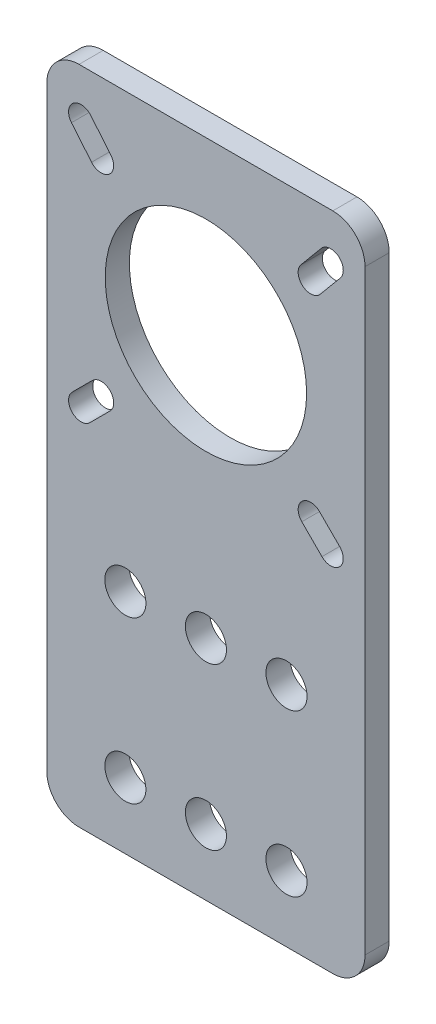
ISO-10303-21;
HEADER;
FILE_DESCRIPTION(('STEP AP214'),'2;1');
FILE_NAME('part.step','',(''),(''),'','','');
FILE_SCHEMA(('AUTOMOTIVE_DESIGN { 1 0 10303 214 1 1 1 1 }'));
ENDSEC;
DATA;
#1=APPLICATION_CONTEXT('core data for automotive mechanical design processes');
#2=APPLICATION_PROTOCOL_DEFINITION('international standard','automotive_design',2000,#1);
#3=PRODUCT_CONTEXT('',#1,'mechanical');
#4=PRODUCT('Part','Part','',(#3));
#5=PRODUCT_RELATED_PRODUCT_CATEGORY('part','',(#4));
#6=PRODUCT_DEFINITION_FORMATION('','',#4);
#7=PRODUCT_DEFINITION_CONTEXT('part definition',#1,'design');
#8=PRODUCT_DEFINITION('design','',#6,#7);
#9=PRODUCT_DEFINITION_SHAPE('','',#8);
#10=(LENGTH_UNIT() NAMED_UNIT(*) SI_UNIT(.MILLI.,.METRE.));
#11=(NAMED_UNIT(*) PLANE_ANGLE_UNIT() SI_UNIT($,.RADIAN.));
#12=(NAMED_UNIT(*) SI_UNIT($,.STERADIAN.) SOLID_ANGLE_UNIT());
#13=UNCERTAINTY_MEASURE_WITH_UNIT(LENGTH_MEASURE(1.E-05),#10,'distance_accuracy_value','');
#14=(GEOMETRIC_REPRESENTATION_CONTEXT(3) GLOBAL_UNCERTAINTY_ASSIGNED_CONTEXT((#13)) GLOBAL_UNIT_ASSIGNED_CONTEXT((#10,
#11,#12)) REPRESENTATION_CONTEXT('',''));
#15=CARTESIAN_POINT('',(0.,0.,0.));
#16=DIRECTION('',(0.,0.,1.));
#17=DIRECTION('',(1.,0.,0.));
#18=AXIS2_PLACEMENT_3D('',#15,#16,#17);
#19=CARTESIAN_POINT('',(-15.75,-37.,3.));
#20=DIRECTION('',(0.,0.,-1.));
#21=DIRECTION('',(-1.,0.,0.));
#22=AXIS2_PLACEMENT_3D('',#19,#20,#21);
#23=PLANE('',#22);
#24=CARTESIAN_POINT('',(-13.,6.75000000000001,3.));
#25=DIRECTION('',(0.,0.,1.));
#26=DIRECTION('',(1.,0.,0.));
#27=AXIS2_PLACEMENT_3D('',#24,#25,#26);
#28=CIRCLE('',#27,1.55);
#29=CARTESIAN_POINT('',(-11.9039844891608,5.65398448916086,3.));
#30=VERTEX_POINT('',#29);
#31=CARTESIAN_POINT('',(-14.0960155108391,7.84601551083916,3.));
#32=VERTEX_POINT('',#31);
#33=EDGE_CURVE('E237',#30,#32,#28,.T.);
#34=ORIENTED_EDGE('',*,*,#33,.F.);
#35=DIRECTION('',(0.707106781186545,0.70710678118655,0.));
#36=VECTOR('',#35,1.);
#37=CARTESIAN_POINT('',(-11.9039844891608,5.65398448916086,3.));
#38=LINE('',#37,#36);
#39=CARTESIAN_POINT('',(-14.4039844891608,3.15398448916085,3.));
#40=VERTEX_POINT('',#39);
#41=EDGE_CURVE('E245',#40,#30,#38,.T.);
#42=ORIENTED_EDGE('',*,*,#41,.F.);
#43=CARTESIAN_POINT('',(-15.5,4.24999999999999,3.));
#44=DIRECTION('',(0.,0.,1.));
#45=DIRECTION('',(1.,0.,0.));
#46=AXIS2_PLACEMENT_3D('',#43,#44,#45);
#47=CIRCLE('',#46,1.55000000000001);
#48=CARTESIAN_POINT('',(-16.5960155108392,5.34601551083914,3.));
#49=VERTEX_POINT('',#48);
#50=EDGE_CURVE('E242',#49,#40,#47,.T.);
#51=ORIENTED_EDGE('',*,*,#50,.F.);
#52=DIRECTION('',(-0.707106781186547,-0.707106781186548,0.));
#53=VECTOR('',#52,1.);
#54=CARTESIAN_POINT('',(-14.0960155108391,7.84601551083916,3.));
#55=LINE('',#54,#53);
#56=EDGE_CURVE('E239',#32,#49,#55,.T.);
#57=ORIENTED_EDGE('',*,*,#56,.F.);
#58=EDGE_LOOP('',(#34,#42,#51,#57));
#59=FACE_BOUND('',#58,.T.);
#60=CARTESIAN_POINT('',(-15.5,35.25,3.));
#61=DIRECTION('',(0.,0.,1.));
#62=DIRECTION('',(1.,0.,0.));
#63=AXIS2_PLACEMENT_3D('',#60,#61,#62);
#64=CIRCLE('',#63,1.55);
#65=CARTESIAN_POINT('',(-14.3092570166241,36.24228581948,3.));
#66=VERTEX_POINT('',#65);
#67=CARTESIAN_POINT('',(-16.6907429833759,34.2577141805201,3.));
#68=VERTEX_POINT('',#67);
#69=EDGE_CURVE('E299',#66,#68,#64,.T.);
#70=ORIENTED_EDGE('',*,*,#69,.F.);
#71=DIRECTION('',(-0.640184399664479,0.768221279597376,0.));
#72=VECTOR('',#71,1.);
#73=CARTESIAN_POINT('',(-14.3092570166241,36.24228581948,3.));
#74=LINE('',#73,#72);
#75=CARTESIAN_POINT('',(-11.8092570166241,33.24228581948,3.));
#76=VERTEX_POINT('',#75);
#77=EDGE_CURVE('E307',#76,#66,#74,.T.);
#78=ORIENTED_EDGE('',*,*,#77,.F.);
#79=CARTESIAN_POINT('',(-13.,32.25,3.));
#80=DIRECTION('',(0.,0.,1.));
#81=DIRECTION('',(1.,0.,0.));
#82=AXIS2_PLACEMENT_3D('',#79,#80,#81);
#83=CIRCLE('',#82,1.55);
#84=CARTESIAN_POINT('',(-14.1907429833759,31.2577141805201,3.));
#85=VERTEX_POINT('',#84);
#86=EDGE_CURVE('E304',#85,#76,#83,.T.);
#87=ORIENTED_EDGE('',*,*,#86,.F.);
#88=DIRECTION('',(0.640184399664479,-0.768221279597376,0.));
#89=VECTOR('',#88,1.);
#90=CARTESIAN_POINT('',(-16.6907429833759,34.2577141805201,3.));
#91=LINE('',#90,#89);
#92=EDGE_CURVE('E301',#68,#85,#91,.T.);
#93=ORIENTED_EDGE('',*,*,#92,.F.);
#94=EDGE_LOOP('',(#70,#78,#87,#93));
#95=FACE_BOUND('',#94,.T.);
#96=CARTESIAN_POINT('',(-15.75,-37.,3.));
#97=DIRECTION('',(0.,0.,1.));
#98=DIRECTION('',(-1.,0.,0.));
#99=AXIS2_PLACEMENT_3D('',#96,#97,#98);
#100=CIRCLE('',#99,4.);
#101=CARTESIAN_POINT('',(-19.75,-37.,3.));
#102=VERTEX_POINT('',#101);
#103=CARTESIAN_POINT('',(-15.75,-41.,3.));
#104=VERTEX_POINT('',#103);
#105=EDGE_CURVE('E336',#102,#104,#100,.T.);
#106=ORIENTED_EDGE('',*,*,#105,.T.);
#107=DIRECTION('',(1.,0.,0.));
#108=VECTOR('',#107,1.);
#109=CARTESIAN_POINT('',(-15.75,-41.,3.));
#110=LINE('',#109,#108);
#111=CARTESIAN_POINT('',(15.75,-41.,3.));
#112=VERTEX_POINT('',#111);
#113=EDGE_CURVE('E339',#104,#112,#110,.T.);
#114=ORIENTED_EDGE('',*,*,#113,.T.);
#115=CARTESIAN_POINT('',(15.75,-37.,3.));
#116=DIRECTION('',(0.,0.,1.));
#117=DIRECTION('',(1.,0.,0.));
#118=AXIS2_PLACEMENT_3D('',#115,#116,#117);
#119=CIRCLE('',#118,4.);
#120=CARTESIAN_POINT('',(19.75,-37.,3.));
#121=VERTEX_POINT('',#120);
#122=EDGE_CURVE('E342',#112,#121,#119,.T.);
#123=ORIENTED_EDGE('',*,*,#122,.T.);
#124=DIRECTION('',(0.,1.,0.));
#125=VECTOR('',#124,1.);
#126=CARTESIAN_POINT('',(19.75,-37.,3.));
#127=LINE('',#126,#125);
#128=CARTESIAN_POINT('',(19.75,37.,3.));
#129=VERTEX_POINT('',#128);
#130=EDGE_CURVE('E344',#121,#129,#127,.T.);
#131=ORIENTED_EDGE('',*,*,#130,.T.);
#132=CARTESIAN_POINT('',(15.75,37.,3.));
#133=DIRECTION('',(0.,0.,1.));
#134=DIRECTION('',(-1.,0.,0.));
#135=AXIS2_PLACEMENT_3D('',#132,#133,#134);
#136=CIRCLE('',#135,4.);
#137=CARTESIAN_POINT('',(15.75,41.,3.));
#138=VERTEX_POINT('',#137);
#139=EDGE_CURVE('E346',#129,#138,#136,.T.);
#140=ORIENTED_EDGE('',*,*,#139,.T.);
#141=DIRECTION('',(-1.,0.,0.));
#142=VECTOR('',#141,1.);
#143=CARTESIAN_POINT('',(-15.75,41.,3.));
#144=LINE('',#143,#142);
#145=CARTESIAN_POINT('',(-15.75,41.,3.));
#146=VERTEX_POINT('',#145);
#147=EDGE_CURVE('E348',#138,#146,#144,.T.);
#148=ORIENTED_EDGE('',*,*,#147,.T.);
#149=CARTESIAN_POINT('',(-15.75,37.,3.));
#150=DIRECTION('',(0.,0.,1.));
#151=DIRECTION('',(-1.,0.,0.));
#152=AXIS2_PLACEMENT_3D('',#149,#150,#151);
#153=CIRCLE('',#152,4.);
#154=CARTESIAN_POINT('',(-19.75,37.,3.));
#155=VERTEX_POINT('',#154);
#156=EDGE_CURVE('E350',#146,#155,#153,.T.);
#157=ORIENTED_EDGE('',*,*,#156,.T.);
#158=DIRECTION('',(0.,-1.,0.));
#159=VECTOR('',#158,1.);
#160=CARTESIAN_POINT('',(-19.75,-37.,3.));
#161=LINE('',#160,#159);
#162=EDGE_CURVE('E352',#155,#102,#161,.T.);
#163=ORIENTED_EDGE('',*,*,#162,.T.);
#164=EDGE_LOOP('',(#106,#114,#123,#131,#140,#148,#157,#163));
#165=FACE_BOUND('',#164,.T.);
#166=CARTESIAN_POINT('',(0.,19.75,3.));
#167=DIRECTION('',(0.,0.,1.));
#168=DIRECTION('',(1.,0.,0.));
#169=AXIS2_PLACEMENT_3D('',#166,#167,#168);
#170=CIRCLE('',#169,12.5);
#171=CARTESIAN_POINT('',(12.5,19.75,3.));
#172=VERTEX_POINT('',#171);
#173=EDGE_CURVE('E330',#172,#172,#170,.T.);
#174=ORIENTED_EDGE('',*,*,#173,.F.);
#175=EDGE_LOOP('',(#174));
#176=FACE_BOUND('',#175,.T.);
#177=CARTESIAN_POINT('',(15.5,35.25,3.));
#178=DIRECTION('',(0.,0.,1.));
#179=DIRECTION('',(-1.,0.,0.));
#180=AXIS2_PLACEMENT_3D('',#177,#178,#179);
#181=CIRCLE('',#180,1.55);
#182=CARTESIAN_POINT('',(16.6907429833759,34.2577141805201,3.));
#183=VERTEX_POINT('',#182);
#184=CARTESIAN_POINT('',(14.3092570166241,36.24228581948,3.));
#185=VERTEX_POINT('',#184);
#186=EDGE_CURVE('E268',#183,#185,#181,.T.);
#187=ORIENTED_EDGE('',*,*,#186,.F.);
#188=DIRECTION('',(0.640184399664479,0.768221279597376,0.));
#189=VECTOR('',#188,1.);
#190=CARTESIAN_POINT('',(16.6907429833759,34.2577141805201,3.));
#191=LINE('',#190,#189);
#192=CARTESIAN_POINT('',(14.1907429833759,31.2577141805201,3.));
#193=VERTEX_POINT('',#192);
#194=EDGE_CURVE('E276',#193,#183,#191,.T.);
#195=ORIENTED_EDGE('',*,*,#194,.F.);
#196=CARTESIAN_POINT('',(13.,32.25,3.));
#197=DIRECTION('',(0.,0.,1.));
#198=DIRECTION('',(-1.,0.,0.));
#199=AXIS2_PLACEMENT_3D('',#196,#197,#198);
#200=CIRCLE('',#199,1.55);
#201=CARTESIAN_POINT('',(11.8092570166241,33.24228581948,3.));
#202=VERTEX_POINT('',#201);
#203=EDGE_CURVE('E273',#202,#193,#200,.T.);
#204=ORIENTED_EDGE('',*,*,#203,.F.);
#205=DIRECTION('',(-0.640184399664479,-0.768221279597376,0.));
#206=VECTOR('',#205,1.);
#207=CARTESIAN_POINT('',(14.3092570166241,36.24228581948,3.));
#208=LINE('',#207,#206);
#209=EDGE_CURVE('E270',#185,#202,#208,.T.);
#210=ORIENTED_EDGE('',*,*,#209,.F.);
#211=EDGE_LOOP('',(#187,#195,#204,#210));
#212=FACE_BOUND('',#211,.T.);
#213=CARTESIAN_POINT('',(13.,6.75000000000001,3.));
#214=DIRECTION('',(0.,0.,1.));
#215=DIRECTION('',(-1.,0.,0.));
#216=AXIS2_PLACEMENT_3D('',#213,#214,#215);
#217=CIRCLE('',#216,1.55);
#218=CARTESIAN_POINT('',(14.0960155108392,7.84601551083916,3.));
#219=VERTEX_POINT('',#218);
#220=CARTESIAN_POINT('',(11.9039844891608,5.65398448916086,3.));
#221=VERTEX_POINT('',#220);
#222=EDGE_CURVE('E198',#219,#221,#217,.T.);
#223=ORIENTED_EDGE('',*,*,#222,.F.);
#224=DIRECTION('',(-0.707106781186547,0.707106781186548,0.));
#225=VECTOR('',#224,1.);
#226=CARTESIAN_POINT('',(14.0960155108392,7.84601551083916,3.));
#227=LINE('',#226,#225);
#228=CARTESIAN_POINT('',(16.5960155108392,5.34601551083914,3.));
#229=VERTEX_POINT('',#228);
#230=EDGE_CURVE('E221',#229,#219,#227,.T.);
#231=ORIENTED_EDGE('',*,*,#230,.F.);
#232=CARTESIAN_POINT('',(15.5,4.24999999999999,3.));
#233=DIRECTION('',(0.,0.,1.));
#234=DIRECTION('',(-1.,0.,0.));
#235=AXIS2_PLACEMENT_3D('',#232,#233,#234);
#236=CIRCLE('',#235,1.55000000000001);
#237=CARTESIAN_POINT('',(14.4039844891608,3.15398448916085,3.));
#238=VERTEX_POINT('',#237);
#239=EDGE_CURVE('E219',#238,#229,#236,.T.);
#240=ORIENTED_EDGE('',*,*,#239,.F.);
#241=DIRECTION('',(0.707106781186544,-0.707106781186551,0.));
#242=VECTOR('',#241,1.);
#243=CARTESIAN_POINT('',(11.9039844891608,5.65398448916086,3.));
#244=LINE('',#243,#242);
#245=EDGE_CURVE('E206',#221,#238,#244,.T.);
#246=ORIENTED_EDGE('',*,*,#245,.F.);
#247=EDGE_LOOP('',(#223,#231,#240,#246));
#248=FACE_BOUND('',#247,.T.);
#249=CARTESIAN_POINT('',(-10.,-12.8,3.));
#250=DIRECTION('',(0.,0.,1.));
#251=DIRECTION('',(1.,0.,0.));
#252=AXIS2_PLACEMENT_3D('',#249,#250,#251);
#253=CIRCLE('',#252,2.55);
#254=CARTESIAN_POINT('',(-7.45,-12.8,3.));
#255=VERTEX_POINT('',#254);
#256=EDGE_CURVE('E227',#255,#255,#253,.T.);
#257=ORIENTED_EDGE('',*,*,#256,.F.);
#258=EDGE_LOOP('',(#257));
#259=FACE_BOUND('',#258,.T.);
#260=CARTESIAN_POINT('',(0.,-12.8,3.));
#261=DIRECTION('',(0.,0.,1.));
#262=DIRECTION('',(1.,0.,0.));
#263=AXIS2_PLACEMENT_3D('',#260,#261,#262);
#264=CIRCLE('',#263,2.55);
#265=CARTESIAN_POINT('',(2.55000000000001,-12.8,3.));
#266=VERTEX_POINT('',#265);
#267=EDGE_CURVE('E506',#266,#266,#264,.T.);
#268=ORIENTED_EDGE('',*,*,#267,.F.);
#269=EDGE_LOOP('',(#268));
#270=FACE_BOUND('',#269,.T.);
#271=CARTESIAN_POINT('',(10.,-12.8,3.));
#272=DIRECTION('',(0.,0.,1.));
#273=DIRECTION('',(1.,0.,0.));
#274=AXIS2_PLACEMENT_3D('',#271,#272,#273);
#275=CIRCLE('',#274,2.55);
#276=CARTESIAN_POINT('',(12.55,-12.8,3.));
#277=VERTEX_POINT('',#276);
#278=EDGE_CURVE('E501',#277,#277,#275,.T.);
#279=ORIENTED_EDGE('',*,*,#278,.F.);
#280=EDGE_LOOP('',(#279));
#281=FACE_BOUND('',#280,.T.);
#282=CARTESIAN_POINT('',(10.,-32.8,3.));
#283=DIRECTION('',(0.,0.,1.));
#284=DIRECTION('',(-1.,0.,0.));
#285=AXIS2_PLACEMENT_3D('',#282,#283,#284);
#286=CIRCLE('',#285,2.55);
#287=CARTESIAN_POINT('',(7.45,-32.8,3.));
#288=VERTEX_POINT('',#287);
#289=EDGE_CURVE('E496',#288,#288,#286,.T.);
#290=ORIENTED_EDGE('',*,*,#289,.F.);
#291=EDGE_LOOP('',(#290));
#292=FACE_BOUND('',#291,.T.);
#293=CARTESIAN_POINT('',(0.,-32.8,3.));
#294=DIRECTION('',(0.,0.,1.));
#295=DIRECTION('',(-1.,0.,0.));
#296=AXIS2_PLACEMENT_3D('',#293,#294,#295);
#297=CIRCLE('',#296,2.55);
#298=CARTESIAN_POINT('',(-2.54999999999999,-32.8,3.));
#299=VERTEX_POINT('',#298);
#300=EDGE_CURVE('E491',#299,#299,#297,.T.);
#301=ORIENTED_EDGE('',*,*,#300,.F.);
#302=EDGE_LOOP('',(#301));
#303=FACE_BOUND('',#302,.T.);
#304=CARTESIAN_POINT('',(-9.99999999999999,-32.8,3.));
#305=DIRECTION('',(0.,0.,1.));
#306=DIRECTION('',(-1.,0.,0.));
#307=AXIS2_PLACEMENT_3D('',#304,#305,#306);
#308=CIRCLE('',#307,2.55);
#309=CARTESIAN_POINT('',(-12.55,-32.8,3.));
#310=VERTEX_POINT('',#309);
#311=EDGE_CURVE('E485',#310,#310,#308,.T.);
#312=ORIENTED_EDGE('',*,*,#311,.F.);
#313=EDGE_LOOP('',(#312));
#314=FACE_BOUND('',#313,.T.);
#315=ADVANCED_FACE('F37',(#59,#95,#165,#176,#212,#248,#259,#270,#281,#292,#303,#314),#23,.F.);
#316=CARTESIAN_POINT('',(-15.75,-37.,0.));
#317=DIRECTION('',(0.,0.,-1.));
#318=DIRECTION('',(-1.,0.,0.));
#319=AXIS2_PLACEMENT_3D('',#316,#317,#318);
#320=PLANE('',#319);
#321=CARTESIAN_POINT('',(0.,-32.8,0.));
#322=DIRECTION('',(0.,0.,1.));
#323=DIRECTION('',(-1.,0.,0.));
#324=AXIS2_PLACEMENT_3D('',#321,#322,#323);
#325=CIRCLE('',#324,2.55);
#326=CARTESIAN_POINT('',(-2.54999999999999,-32.8,0.));
#327=VERTEX_POINT('',#326);
#328=EDGE_CURVE('E488',#327,#327,#325,.T.);
#329=ORIENTED_EDGE('',*,*,#328,.T.);
#330=EDGE_LOOP('',(#329));
#331=FACE_BOUND('',#330,.T.);
#332=CARTESIAN_POINT('',(10.,-12.8,0.));
#333=DIRECTION('',(0.,0.,1.));
#334=DIRECTION('',(1.,0.,0.));
#335=AXIS2_PLACEMENT_3D('',#332,#333,#334);
#336=CIRCLE('',#335,2.55);
#337=CARTESIAN_POINT('',(12.55,-12.8,0.));
#338=VERTEX_POINT('',#337);
#339=EDGE_CURVE('E499',#338,#338,#336,.T.);
#340=ORIENTED_EDGE('',*,*,#339,.T.);
#341=EDGE_LOOP('',(#340));
#342=FACE_BOUND('',#341,.T.);
#343=CARTESIAN_POINT('',(-10.,-12.8,0.));
#344=DIRECTION('',(0.,0.,1.));
#345=DIRECTION('',(1.,0.,0.));
#346=AXIS2_PLACEMENT_3D('',#343,#344,#345);
#347=CIRCLE('',#346,2.55);
#348=CARTESIAN_POINT('',(-7.45,-12.8,0.));
#349=VERTEX_POINT('',#348);
#350=EDGE_CURVE('E509',#349,#349,#347,.T.);
#351=ORIENTED_EDGE('',*,*,#350,.T.);
#352=EDGE_LOOP('',(#351));
#353=FACE_BOUND('',#352,.T.);
#354=CARTESIAN_POINT('',(-15.75,-37.,0.));
#355=DIRECTION('',(0.,0.,1.));
#356=DIRECTION('',(-1.,0.,0.));
#357=AXIS2_PLACEMENT_3D('',#354,#355,#356);
#358=CIRCLE('',#357,4.);
#359=CARTESIAN_POINT('',(-19.75,-37.,0.));
#360=VERTEX_POINT('',#359);
#361=CARTESIAN_POINT('',(-15.75,-41.,0.));
#362=VERTEX_POINT('',#361);
#363=EDGE_CURVE('E333',#360,#362,#358,.T.);
#364=ORIENTED_EDGE('',*,*,#363,.F.);
#365=DIRECTION('',(0.,-1.,0.));
#366=VECTOR('',#365,1.);
#367=CARTESIAN_POINT('',(-19.75,-37.,0.));
#368=LINE('',#367,#366);
#369=CARTESIAN_POINT('',(-19.75,37.,0.));
#370=VERTEX_POINT('',#369);
#371=EDGE_CURVE('E340',#370,#360,#368,.T.);
#372=ORIENTED_EDGE('',*,*,#371,.F.);
#373=CARTESIAN_POINT('',(-15.75,37.,0.));
#374=DIRECTION('',(0.,0.,1.));
#375=DIRECTION('',(-1.,0.,0.));
#376=AXIS2_PLACEMENT_3D('',#373,#374,#375);
#377=CIRCLE('',#376,4.);
#378=CARTESIAN_POINT('',(-15.75,41.,0.));
#379=VERTEX_POINT('',#378);
#380=EDGE_CURVE('E367',#379,#370,#377,.T.);
#381=ORIENTED_EDGE('',*,*,#380,.F.);
#382=DIRECTION('',(-1.,0.,0.));
#383=VECTOR('',#382,1.);
#384=CARTESIAN_POINT('',(-15.75,41.,0.));
#385=LINE('',#384,#383);
#386=CARTESIAN_POINT('',(15.75,41.,0.));
#387=VERTEX_POINT('',#386);
#388=EDGE_CURVE('E365',#387,#379,#385,.T.);
#389=ORIENTED_EDGE('',*,*,#388,.F.);
#390=CARTESIAN_POINT('',(15.75,37.,0.));
#391=DIRECTION('',(0.,0.,1.));
#392=DIRECTION('',(-1.,0.,0.));
#393=AXIS2_PLACEMENT_3D('',#390,#391,#392);
#394=CIRCLE('',#393,4.);
#395=CARTESIAN_POINT('',(19.75,37.,0.));
#396=VERTEX_POINT('',#395);
#397=EDGE_CURVE('E363',#396,#387,#394,.T.);
#398=ORIENTED_EDGE('',*,*,#397,.F.);
#399=DIRECTION('',(0.,1.,0.));
#400=VECTOR('',#399,1.);
#401=CARTESIAN_POINT('',(19.75,-37.,0.));
#402=LINE('',#401,#400);
#403=CARTESIAN_POINT('',(19.75,-37.,0.));
#404=VERTEX_POINT('',#403);
#405=EDGE_CURVE('E361',#404,#396,#402,.T.);
#406=ORIENTED_EDGE('',*,*,#405,.F.);
#407=CARTESIAN_POINT('',(15.75,-37.,0.));
#408=DIRECTION('',(0.,0.,1.));
#409=DIRECTION('',(1.,0.,0.));
#410=AXIS2_PLACEMENT_3D('',#407,#408,#409);
#411=CIRCLE('',#410,4.);
#412=CARTESIAN_POINT('',(15.75,-41.,0.));
#413=VERTEX_POINT('',#412);
#414=EDGE_CURVE('E359',#413,#404,#411,.T.);
#415=ORIENTED_EDGE('',*,*,#414,.F.);
#416=DIRECTION('',(1.,0.,0.));
#417=VECTOR('',#416,1.);
#418=CARTESIAN_POINT('',(-15.75,-41.,0.));
#419=LINE('',#418,#417);
#420=EDGE_CURVE('E357',#362,#413,#419,.T.);
#421=ORIENTED_EDGE('',*,*,#420,.F.);
#422=EDGE_LOOP('',(#364,#372,#381,#389,#398,#406,#415,#421));
#423=FACE_BOUND('',#422,.T.);
#424=CARTESIAN_POINT('',(0.,19.75,0.));
#425=DIRECTION('',(0.,0.,1.));
#426=DIRECTION('',(1.,0.,0.));
#427=AXIS2_PLACEMENT_3D('',#424,#425,#426);
#428=CIRCLE('',#427,12.5);
#429=CARTESIAN_POINT('',(12.5,19.75,0.));
#430=VERTEX_POINT('',#429);
#431=EDGE_CURVE('E329',#430,#430,#428,.T.);
#432=ORIENTED_EDGE('',*,*,#431,.T.);
#433=EDGE_LOOP('',(#432));
#434=FACE_BOUND('',#433,.T.);
#435=DIRECTION('',(-0.640184399664479,0.768221279597376,0.));
#436=VECTOR('',#435,1.);
#437=CARTESIAN_POINT('',(-14.3092570166241,36.24228581948,0.));
#438=LINE('',#437,#436);
#439=CARTESIAN_POINT('',(-11.8092570166241,33.24228581948,0.));
#440=VERTEX_POINT('',#439);
#441=CARTESIAN_POINT('',(-14.3092570166241,36.24228581948,0.));
#442=VERTEX_POINT('',#441);
#443=EDGE_CURVE('E302',#440,#442,#438,.T.);
#444=ORIENTED_EDGE('',*,*,#443,.T.);
#445=CARTESIAN_POINT('',(-15.5,35.25,0.));
#446=DIRECTION('',(0.,0.,1.));
#447=DIRECTION('',(1.,0.,0.));
#448=AXIS2_PLACEMENT_3D('',#445,#446,#447);
#449=CIRCLE('',#448,1.55);
#450=CARTESIAN_POINT('',(-16.6907429833759,34.2577141805201,0.));
#451=VERTEX_POINT('',#450);
#452=EDGE_CURVE('E298',#442,#451,#449,.T.);
#453=ORIENTED_EDGE('',*,*,#452,.T.);
#454=DIRECTION('',(0.640184399664479,-0.768221279597376,0.));
#455=VECTOR('',#454,1.);
#456=CARTESIAN_POINT('',(-16.6907429833759,34.2577141805201,0.));
#457=LINE('',#456,#455);
#458=CARTESIAN_POINT('',(-14.1907429833759,31.2577141805201,0.));
#459=VERTEX_POINT('',#458);
#460=EDGE_CURVE('E312',#451,#459,#457,.T.);
#461=ORIENTED_EDGE('',*,*,#460,.T.);
#462=CARTESIAN_POINT('',(-13.,32.25,0.));
#463=DIRECTION('',(0.,0.,1.));
#464=DIRECTION('',(1.,0.,0.));
#465=AXIS2_PLACEMENT_3D('',#462,#463,#464);
#466=CIRCLE('',#465,1.55);
#467=EDGE_CURVE('E315',#459,#440,#466,.T.);
#468=ORIENTED_EDGE('',*,*,#467,.T.);
#469=EDGE_LOOP('',(#444,#453,#461,#468));
#470=FACE_BOUND('',#469,.T.);
#471=DIRECTION('',(0.640184399664479,0.768221279597376,0.));
#472=VECTOR('',#471,1.);
#473=CARTESIAN_POINT('',(16.6907429833759,34.2577141805201,0.));
#474=LINE('',#473,#472);
#475=CARTESIAN_POINT('',(14.1907429833759,31.2577141805201,0.));
#476=VERTEX_POINT('',#475);
#477=CARTESIAN_POINT('',(16.6907429833759,34.2577141805201,0.));
#478=VERTEX_POINT('',#477);
#479=EDGE_CURVE('E271',#476,#478,#474,.T.);
#480=ORIENTED_EDGE('',*,*,#479,.T.);
#481=CARTESIAN_POINT('',(15.5,35.25,0.));
#482=DIRECTION('',(0.,0.,1.));
#483=DIRECTION('',(-1.,0.,0.));
#484=AXIS2_PLACEMENT_3D('',#481,#482,#483);
#485=CIRCLE('',#484,1.55);
#486=CARTESIAN_POINT('',(14.3092570166241,36.24228581948,0.));
#487=VERTEX_POINT('',#486);
#488=EDGE_CURVE('E267',#478,#487,#485,.T.);
#489=ORIENTED_EDGE('',*,*,#488,.T.);
#490=DIRECTION('',(-0.640184399664479,-0.768221279597376,0.));
#491=VECTOR('',#490,1.);
#492=CARTESIAN_POINT('',(14.3092570166241,36.24228581948,0.));
#493=LINE('',#492,#491);
#494=CARTESIAN_POINT('',(11.8092570166241,33.24228581948,0.));
#495=VERTEX_POINT('',#494);
#496=EDGE_CURVE('E281',#487,#495,#493,.T.);
#497=ORIENTED_EDGE('',*,*,#496,.T.);
#498=CARTESIAN_POINT('',(13.,32.25,0.));
#499=DIRECTION('',(0.,0.,1.));
#500=DIRECTION('',(-1.,0.,0.));
#501=AXIS2_PLACEMENT_3D('',#498,#499,#500);
#502=CIRCLE('',#501,1.55);
#503=EDGE_CURVE('E284',#495,#476,#502,.T.);
#504=ORIENTED_EDGE('',*,*,#503,.T.);
#505=EDGE_LOOP('',(#480,#489,#497,#504));
#506=FACE_BOUND('',#505,.T.);
#507=DIRECTION('',(0.707106781186545,0.70710678118655,0.));
#508=VECTOR('',#507,1.);
#509=CARTESIAN_POINT('',(-11.9039844891608,5.65398448916086,0.));
#510=LINE('',#509,#508);
#511=CARTESIAN_POINT('',(-14.4039844891608,3.15398448916084,0.));
#512=VERTEX_POINT('',#511);
#513=CARTESIAN_POINT('',(-11.9039844891608,5.65398448916086,0.));
#514=VERTEX_POINT('',#513);
#515=EDGE_CURVE('E240',#512,#514,#510,.T.);
#516=ORIENTED_EDGE('',*,*,#515,.T.);
#517=CARTESIAN_POINT('',(-13.,6.75000000000001,0.));
#518=DIRECTION('',(0.,0.,1.));
#519=DIRECTION('',(1.,0.,0.));
#520=AXIS2_PLACEMENT_3D('',#517,#518,#519);
#521=CIRCLE('',#520,1.55);
#522=CARTESIAN_POINT('',(-14.0960155108391,7.84601551083916,0.));
#523=VERTEX_POINT('',#522);
#524=EDGE_CURVE('E214',#514,#523,#521,.T.);
#525=ORIENTED_EDGE('',*,*,#524,.T.);
#526=DIRECTION('',(-0.707106781186547,-0.707106781186548,0.));
#527=VECTOR('',#526,1.);
#528=CARTESIAN_POINT('',(-14.0960155108391,7.84601551083916,0.));
#529=LINE('',#528,#527);
#530=CARTESIAN_POINT('',(-16.5960155108392,5.34601551083914,0.));
#531=VERTEX_POINT('',#530);
#532=EDGE_CURVE('E250',#523,#531,#529,.T.);
#533=ORIENTED_EDGE('',*,*,#532,.T.);
#534=CARTESIAN_POINT('',(-15.5,4.24999999999999,0.));
#535=DIRECTION('',(0.,0.,1.));
#536=DIRECTION('',(1.,0.,0.));
#537=AXIS2_PLACEMENT_3D('',#534,#535,#536);
#538=CIRCLE('',#537,1.55000000000001);
#539=EDGE_CURVE('E253',#531,#512,#538,.T.);
#540=ORIENTED_EDGE('',*,*,#539,.T.);
#541=EDGE_LOOP('',(#516,#525,#533,#540));
#542=FACE_BOUND('',#541,.T.);
#543=DIRECTION('',(-0.707106781186547,0.707106781186548,0.));
#544=VECTOR('',#543,1.);
#545=CARTESIAN_POINT('',(14.0960155108392,7.84601551083916,0.));
#546=LINE('',#545,#544);
#547=CARTESIAN_POINT('',(16.5960155108392,5.34601551083914,0.));
#548=VERTEX_POINT('',#547);
#549=CARTESIAN_POINT('',(14.0960155108392,7.84601551083915,0.));
#550=VERTEX_POINT('',#549);
#551=EDGE_CURVE('E207',#548,#550,#546,.T.);
#552=ORIENTED_EDGE('',*,*,#551,.T.);
#553=CARTESIAN_POINT('',(13.,6.75000000000001,0.));
#554=DIRECTION('',(0.,0.,1.));
#555=DIRECTION('',(-1.,0.,0.));
#556=AXIS2_PLACEMENT_3D('',#553,#554,#555);
#557=CIRCLE('',#556,1.55);
#558=CARTESIAN_POINT('',(11.9039844891608,5.65398448916086,0.));
#559=VERTEX_POINT('',#558);
#560=EDGE_CURVE('E60',#550,#559,#557,.T.);
#561=ORIENTED_EDGE('',*,*,#560,.T.);
#562=DIRECTION('',(0.707106781186544,-0.707106781186551,0.));
#563=VECTOR('',#562,1.);
#564=CARTESIAN_POINT('',(11.9039844891608,5.65398448916086,0.));
#565=LINE('',#564,#563);
#566=CARTESIAN_POINT('',(14.4039844891608,3.15398448916085,0.));
#567=VERTEX_POINT('',#566);
#568=EDGE_CURVE('E213',#559,#567,#565,.T.);
#569=ORIENTED_EDGE('',*,*,#568,.T.);
#570=CARTESIAN_POINT('',(15.5,4.24999999999999,0.));
#571=DIRECTION('',(0.,0.,1.));
#572=DIRECTION('',(-1.,0.,0.));
#573=AXIS2_PLACEMENT_3D('',#570,#571,#572);
#574=CIRCLE('',#573,1.55000000000001);
#575=EDGE_CURVE('E229',#567,#548,#574,.T.);
#576=ORIENTED_EDGE('',*,*,#575,.T.);
#577=EDGE_LOOP('',(#552,#561,#569,#576));
#578=FACE_BOUND('',#577,.T.);
#579=CARTESIAN_POINT('',(0.,-12.8,0.));
#580=DIRECTION('',(0.,0.,1.));
#581=DIRECTION('',(1.,0.,0.));
#582=AXIS2_PLACEMENT_3D('',#579,#580,#581);
#583=CIRCLE('',#582,2.55);
#584=CARTESIAN_POINT('',(2.55000000000001,-12.8,0.));
#585=VERTEX_POINT('',#584);
#586=EDGE_CURVE('E476',#585,#585,#583,.T.);
#587=ORIENTED_EDGE('',*,*,#586,.T.);
#588=EDGE_LOOP('',(#587));
#589=FACE_BOUND('',#588,.T.);
#590=CARTESIAN_POINT('',(10.,-32.8,0.));
#591=DIRECTION('',(0.,0.,1.));
#592=DIRECTION('',(-1.,0.,0.));
#593=AXIS2_PLACEMENT_3D('',#590,#591,#592);
#594=CIRCLE('',#593,2.55);
#595=CARTESIAN_POINT('',(7.45,-32.8,0.));
#596=VERTEX_POINT('',#595);
#597=EDGE_CURVE('E480',#596,#596,#594,.T.);
#598=ORIENTED_EDGE('',*,*,#597,.T.);
#599=EDGE_LOOP('',(#598));
#600=FACE_BOUND('',#599,.T.);
#601=CARTESIAN_POINT('',(-9.99999999999999,-32.8,0.));
#602=DIRECTION('',(0.,0.,1.));
#603=DIRECTION('',(-1.,0.,0.));
#604=AXIS2_PLACEMENT_3D('',#601,#602,#603);
#605=CIRCLE('',#604,2.55);
#606=CARTESIAN_POINT('',(-12.55,-32.8,0.));
#607=VERTEX_POINT('',#606);
#608=EDGE_CURVE('E483',#607,#607,#605,.T.);
#609=ORIENTED_EDGE('',*,*,#608,.T.);
#610=EDGE_LOOP('',(#609));
#611=FACE_BOUND('',#610,.T.);
#612=ADVANCED_FACE('F397',(#331,#342,#353,#423,#434,#470,#506,#542,#578,#589,#600,#611),#320,.T.);
#613=CARTESIAN_POINT('',(-15.75,-37.,3.));
#614=DIRECTION('',(0.,0.,-1.));
#615=DIRECTION('',(-1.,0.,0.));
#616=AXIS2_PLACEMENT_3D('',#613,#614,#615);
#617=CYLINDRICAL_SURFACE('',#616,4.);
#618=ORIENTED_EDGE('',*,*,#363,.T.);
#619=DIRECTION('',(0.,0.,-1.));
#620=VECTOR('',#619,1.);
#621=CARTESIAN_POINT('',(-15.75,-41.,3.));
#622=LINE('',#621,#620);
#623=EDGE_CURVE('E11',#104,#362,#622,.T.);
#624=ORIENTED_EDGE('',*,*,#623,.F.);
#625=ORIENTED_EDGE('',*,*,#105,.F.);
#626=DIRECTION('',(0.,0.,-1.));
#627=VECTOR('',#626,1.);
#628=CARTESIAN_POINT('',(-19.75,-37.,3.));
#629=LINE('',#628,#627);
#630=EDGE_CURVE('E354',#102,#360,#629,.T.);
#631=ORIENTED_EDGE('',*,*,#630,.T.);
#632=EDGE_LOOP('',(#618,#624,#625,#631));
#633=FACE_BOUND('',#632,.T.);
#634=ADVANCED_FACE('F39',(#633),#617,.T.);
#635=CARTESIAN_POINT('',(-15.75,-41.,3.));
#636=DIRECTION('',(0.,1.,0.));
#637=DIRECTION('',(0.,0.,1.));
#638=AXIS2_PLACEMENT_3D('',#635,#636,#637);
#639=PLANE('',#638);
#640=ORIENTED_EDGE('',*,*,#420,.T.);
#641=DIRECTION('',(0.,0.,-1.));
#642=VECTOR('',#641,1.);
#643=CARTESIAN_POINT('',(15.75,-41.,3.));
#644=LINE('',#643,#642);
#645=EDGE_CURVE('E45',#112,#413,#644,.T.);
#646=ORIENTED_EDGE('',*,*,#645,.F.);
#647=ORIENTED_EDGE('',*,*,#113,.F.);
#648=ORIENTED_EDGE('',*,*,#623,.T.);
#649=EDGE_LOOP('',(#640,#646,#647,#648));
#650=FACE_BOUND('',#649,.T.);
#651=ADVANCED_FACE('F415',(#650),#639,.F.);
#652=CARTESIAN_POINT('',(15.75,-37.,3.));
#653=DIRECTION('',(0.,0.,-1.));
#654=DIRECTION('',(-1.,0.,0.));
#655=AXIS2_PLACEMENT_3D('',#652,#653,#654);
#656=CYLINDRICAL_SURFACE('',#655,4.);
#657=ORIENTED_EDGE('',*,*,#414,.T.);
#658=DIRECTION('',(0.,0.,-1.));
#659=VECTOR('',#658,1.);
#660=CARTESIAN_POINT('',(19.75,-37.,3.));
#661=LINE('',#660,#659);
#662=EDGE_CURVE('E384',#121,#404,#661,.T.);
#663=ORIENTED_EDGE('',*,*,#662,.F.);
#664=ORIENTED_EDGE('',*,*,#122,.F.);
#665=ORIENTED_EDGE('',*,*,#645,.T.);
#666=EDGE_LOOP('',(#657,#663,#664,#665));
#667=FACE_BOUND('',#666,.T.);
#668=ADVANCED_FACE('F391',(#667),#656,.T.);
#669=CARTESIAN_POINT('',(19.75,-37.,3.));
#670=DIRECTION('',(-1.,0.,0.));
#671=DIRECTION('',(0.,0.,1.));
#672=AXIS2_PLACEMENT_3D('',#669,#670,#671);
#673=PLANE('',#672);
#674=ORIENTED_EDGE('',*,*,#405,.T.);
#675=DIRECTION('',(0.,0.,-1.));
#676=VECTOR('',#675,1.);
#677=CARTESIAN_POINT('',(19.75,37.,3.));
#678=LINE('',#677,#676);
#679=EDGE_CURVE('E381',#129,#396,#678,.T.);
#680=ORIENTED_EDGE('',*,*,#679,.F.);
#681=ORIENTED_EDGE('',*,*,#130,.F.);
#682=ORIENTED_EDGE('',*,*,#662,.T.);
#683=EDGE_LOOP('',(#674,#680,#681,#682));
#684=FACE_BOUND('',#683,.T.);
#685=ADVANCED_FACE('F403',(#684),#673,.F.);
#686=CARTESIAN_POINT('',(15.75,37.,3.));
#687=DIRECTION('',(0.,0.,-1.));
#688=DIRECTION('',(-1.,0.,0.));
#689=AXIS2_PLACEMENT_3D('',#686,#687,#688);
#690=CYLINDRICAL_SURFACE('',#689,4.);
#691=ORIENTED_EDGE('',*,*,#397,.T.);
#692=DIRECTION('',(0.,0.,-1.));
#693=VECTOR('',#692,1.);
#694=CARTESIAN_POINT('',(15.75,41.,3.));
#695=LINE('',#694,#693);
#696=EDGE_CURVE('E378',#138,#387,#695,.T.);
#697=ORIENTED_EDGE('',*,*,#696,.F.);
#698=ORIENTED_EDGE('',*,*,#139,.F.);
#699=ORIENTED_EDGE('',*,*,#679,.T.);
#700=EDGE_LOOP('',(#691,#697,#698,#699));
#701=FACE_BOUND('',#700,.T.);
#702=ADVANCED_FACE('F407',(#701),#690,.T.);
#703=CARTESIAN_POINT('',(-15.75,41.,3.));
#704=DIRECTION('',(0.,-1.,0.));
#705=DIRECTION('',(0.,0.,-1.));
#706=AXIS2_PLACEMENT_3D('',#703,#704,#705);
#707=PLANE('',#706);
#708=ORIENTED_EDGE('',*,*,#388,.T.);
#709=DIRECTION('',(0.,0.,-1.));
#710=VECTOR('',#709,1.);
#711=CARTESIAN_POINT('',(-15.75,41.,3.));
#712=LINE('',#711,#710);
#713=EDGE_CURVE('E375',#146,#379,#712,.T.);
#714=ORIENTED_EDGE('',*,*,#713,.F.);
#715=ORIENTED_EDGE('',*,*,#147,.F.);
#716=ORIENTED_EDGE('',*,*,#696,.T.);
#717=EDGE_LOOP('',(#708,#714,#715,#716));
#718=FACE_BOUND('',#717,.T.);
#719=ADVANCED_FACE('F428',(#718),#707,.F.);
#720=CARTESIAN_POINT('',(-15.75,37.,3.));
#721=DIRECTION('',(0.,0.,-1.));
#722=DIRECTION('',(-1.,0.,0.));
#723=AXIS2_PLACEMENT_3D('',#720,#721,#722);
#724=CYLINDRICAL_SURFACE('',#723,4.);
#725=ORIENTED_EDGE('',*,*,#380,.T.);
#726=DIRECTION('',(0.,0.,-1.));
#727=VECTOR('',#726,1.);
#728=CARTESIAN_POINT('',(-19.75,37.,3.));
#729=LINE('',#728,#727);
#730=EDGE_CURVE('E372',#155,#370,#729,.T.);
#731=ORIENTED_EDGE('',*,*,#730,.F.);
#732=ORIENTED_EDGE('',*,*,#156,.F.);
#733=ORIENTED_EDGE('',*,*,#713,.T.);
#734=EDGE_LOOP('',(#725,#731,#732,#733));
#735=FACE_BOUND('',#734,.T.);
#736=ADVANCED_FACE('F426',(#735),#724,.T.);
#737=CARTESIAN_POINT('',(-19.75,-37.,3.));
#738=DIRECTION('',(1.,0.,0.));
#739=DIRECTION('',(0.,0.,-1.));
#740=AXIS2_PLACEMENT_3D('',#737,#738,#739);
#741=PLANE('',#740);
#742=ORIENTED_EDGE('',*,*,#371,.T.);
#743=ORIENTED_EDGE('',*,*,#630,.F.);
#744=ORIENTED_EDGE('',*,*,#162,.F.);
#745=ORIENTED_EDGE('',*,*,#730,.T.);
#746=EDGE_LOOP('',(#742,#743,#744,#745));
#747=FACE_BOUND('',#746,.T.);
#748=ADVANCED_FACE('F421',(#747),#741,.F.);
#749=CARTESIAN_POINT('',(0.,19.75,3.));
#750=DIRECTION('',(0.,0.,-1.));
#751=DIRECTION('',(-1.,0.,0.));
#752=AXIS2_PLACEMENT_3D('',#749,#750,#751);
#753=CYLINDRICAL_SURFACE('',#752,12.5);
#754=ORIENTED_EDGE('',*,*,#173,.T.);
#755=EDGE_LOOP('',(#754));
#756=FACE_BOUND('',#755,.T.);
#757=ORIENTED_EDGE('',*,*,#431,.F.);
#758=EDGE_LOOP('',(#757));
#759=FACE_BOUND('',#758,.T.);
#760=ADVANCED_FACE('F448',(#756,#759),#753,.F.);
#761=CARTESIAN_POINT('',(-15.5,35.25,3.));
#762=DIRECTION('',(0.,0.,-1.));
#763=DIRECTION('',(-1.,0.,0.));
#764=AXIS2_PLACEMENT_3D('',#761,#762,#763);
#765=CYLINDRICAL_SURFACE('',#764,1.55);
#766=ORIENTED_EDGE('',*,*,#452,.F.);
#767=DIRECTION('',(0.,0.,-1.));
#768=VECTOR('',#767,1.);
#769=CARTESIAN_POINT('',(-14.3092570166241,36.24228581948,3.));
#770=LINE('',#769,#768);
#771=EDGE_CURVE('E309',#66,#442,#770,.T.);
#772=ORIENTED_EDGE('',*,*,#771,.F.);
#773=ORIENTED_EDGE('',*,*,#69,.T.);
#774=DIRECTION('',(0.,0.,-1.));
#775=VECTOR('',#774,1.);
#776=CARTESIAN_POINT('',(-16.6907429833759,34.2577141805201,3.));
#777=LINE('',#776,#775);
#778=EDGE_CURVE('E326',#68,#451,#777,.T.);
#779=ORIENTED_EDGE('',*,*,#778,.T.);
#780=EDGE_LOOP('',(#766,#772,#773,#779));
#781=FACE_BOUND('',#780,.T.);
#782=ADVANCED_FACE('F455',(#781),#765,.F.);
#783=CARTESIAN_POINT('',(-16.6907429833759,34.2577141805201,3.));
#784=DIRECTION('',(0.768221279597376,0.640184399664479,0.));
#785=DIRECTION('',(-0.640184399664479,0.768221279597376,0.));
#786=AXIS2_PLACEMENT_3D('',#783,#784,#785);
#787=PLANE('',#786);
#788=ORIENTED_EDGE('',*,*,#460,.F.);
#789=ORIENTED_EDGE('',*,*,#778,.F.);
#790=ORIENTED_EDGE('',*,*,#92,.T.);
#791=DIRECTION('',(0.,0.,-1.));
#792=VECTOR('',#791,1.);
#793=CARTESIAN_POINT('',(-14.1907429833759,31.2577141805201,3.));
#794=LINE('',#793,#792);
#795=EDGE_CURVE('E324',#85,#459,#794,.T.);
#796=ORIENTED_EDGE('',*,*,#795,.T.);
#797=EDGE_LOOP('',(#788,#789,#790,#796));
#798=FACE_BOUND('',#797,.T.);
#799=ADVANCED_FACE('F460',(#798),#787,.T.);
#800=CARTESIAN_POINT('',(-13.,32.25,3.));
#801=DIRECTION('',(0.,0.,-1.));
#802=DIRECTION('',(-1.,0.,0.));
#803=AXIS2_PLACEMENT_3D('',#800,#801,#802);
#804=CYLINDRICAL_SURFACE('',#803,1.55);
#805=ORIENTED_EDGE('',*,*,#467,.F.);
#806=ORIENTED_EDGE('',*,*,#795,.F.);
#807=ORIENTED_EDGE('',*,*,#86,.T.);
#808=DIRECTION('',(0.,0.,-1.));
#809=VECTOR('',#808,1.);
#810=CARTESIAN_POINT('',(-11.8092570166241,33.24228581948,3.));
#811=LINE('',#810,#809);
#812=EDGE_CURVE('E322',#76,#440,#811,.T.);
#813=ORIENTED_EDGE('',*,*,#812,.T.);
#814=EDGE_LOOP('',(#805,#806,#807,#813));
#815=FACE_BOUND('',#814,.T.);
#816=ADVANCED_FACE('F575',(#815),#804,.F.);
#817=CARTESIAN_POINT('',(-14.3092570166241,36.24228581948,3.));
#818=DIRECTION('',(-0.768221279597376,-0.640184399664479,0.));
#819=DIRECTION('',(0.640184399664479,-0.768221279597376,0.));
#820=AXIS2_PLACEMENT_3D('',#817,#818,#819);
#821=PLANE('',#820);
#822=ORIENTED_EDGE('',*,*,#443,.F.);
#823=ORIENTED_EDGE('',*,*,#812,.F.);
#824=ORIENTED_EDGE('',*,*,#77,.T.);
#825=ORIENTED_EDGE('',*,*,#771,.T.);
#826=EDGE_LOOP('',(#822,#823,#824,#825));
#827=FACE_BOUND('',#826,.T.);
#828=ADVANCED_FACE('F571',(#827),#821,.T.);
#829=CARTESIAN_POINT('',(15.5,35.25,3.));
#830=DIRECTION('',(0.,0.,-1.));
#831=DIRECTION('',(-1.,0.,0.));
#832=AXIS2_PLACEMENT_3D('',#829,#830,#831);
#833=CYLINDRICAL_SURFACE('',#832,1.55);
#834=ORIENTED_EDGE('',*,*,#488,.F.);
#835=DIRECTION('',(0.,0.,-1.));
#836=VECTOR('',#835,1.);
#837=CARTESIAN_POINT('',(16.6907429833759,34.2577141805201,3.));
#838=LINE('',#837,#836);
#839=EDGE_CURVE('E278',#183,#478,#838,.T.);
#840=ORIENTED_EDGE('',*,*,#839,.F.);
#841=ORIENTED_EDGE('',*,*,#186,.T.);
#842=DIRECTION('',(0.,0.,-1.));
#843=VECTOR('',#842,1.);
#844=CARTESIAN_POINT('',(14.3092570166241,36.24228581948,3.));
#845=LINE('',#844,#843);
#846=EDGE_CURVE('E295',#185,#487,#845,.T.);
#847=ORIENTED_EDGE('',*,*,#846,.T.);
#848=EDGE_LOOP('',(#834,#840,#841,#847));
#849=FACE_BOUND('',#848,.T.);
#850=ADVANCED_FACE('F567',(#849),#833,.F.);
#851=CARTESIAN_POINT('',(14.3092570166241,36.24228581948,3.));
#852=DIRECTION('',(0.768221279597376,-0.640184399664479,0.));
#853=DIRECTION('',(0.640184399664479,0.768221279597376,0.));
#854=AXIS2_PLACEMENT_3D('',#851,#852,#853);
#855=PLANE('',#854);
#856=ORIENTED_EDGE('',*,*,#496,.F.);
#857=ORIENTED_EDGE('',*,*,#846,.F.);
#858=ORIENTED_EDGE('',*,*,#209,.T.);
#859=DIRECTION('',(0.,0.,-1.));
#860=VECTOR('',#859,1.);
#861=CARTESIAN_POINT('',(11.8092570166241,33.24228581948,3.));
#862=LINE('',#861,#860);
#863=EDGE_CURVE('E293',#202,#495,#862,.T.);
#864=ORIENTED_EDGE('',*,*,#863,.T.);
#865=EDGE_LOOP('',(#856,#857,#858,#864));
#866=FACE_BOUND('',#865,.T.);
#867=ADVANCED_FACE('F563',(#866),#855,.T.);
#868=CARTESIAN_POINT('',(13.,32.25,3.));
#869=DIRECTION('',(0.,0.,-1.));
#870=DIRECTION('',(-1.,0.,0.));
#871=AXIS2_PLACEMENT_3D('',#868,#869,#870);
#872=CYLINDRICAL_SURFACE('',#871,1.55);
#873=ORIENTED_EDGE('',*,*,#503,.F.);
#874=ORIENTED_EDGE('',*,*,#863,.F.);
#875=ORIENTED_EDGE('',*,*,#203,.T.);
#876=DIRECTION('',(0.,0.,-1.));
#877=VECTOR('',#876,1.);
#878=CARTESIAN_POINT('',(14.1907429833759,31.2577141805201,3.));
#879=LINE('',#878,#877);
#880=EDGE_CURVE('E291',#193,#476,#879,.T.);
#881=ORIENTED_EDGE('',*,*,#880,.T.);
#882=EDGE_LOOP('',(#873,#874,#875,#881));
#883=FACE_BOUND('',#882,.T.);
#884=ADVANCED_FACE('F559',(#883),#872,.F.);
#885=CARTESIAN_POINT('',(16.6907429833759,34.2577141805201,3.));
#886=DIRECTION('',(-0.768221279597376,0.640184399664479,0.));
#887=DIRECTION('',(-0.640184399664479,-0.768221279597376,0.));
#888=AXIS2_PLACEMENT_3D('',#885,#886,#887);
#889=PLANE('',#888);
#890=ORIENTED_EDGE('',*,*,#479,.F.);
#891=ORIENTED_EDGE('',*,*,#880,.F.);
#892=ORIENTED_EDGE('',*,*,#194,.T.);
#893=ORIENTED_EDGE('',*,*,#839,.T.);
#894=EDGE_LOOP('',(#890,#891,#892,#893));
#895=FACE_BOUND('',#894,.T.);
#896=ADVANCED_FACE('F555',(#895),#889,.T.);
#897=CARTESIAN_POINT('',(-13.,6.75000000000001,3.));
#898=DIRECTION('',(0.,0.,-1.));
#899=DIRECTION('',(-1.,0.,0.));
#900=AXIS2_PLACEMENT_3D('',#897,#898,#899);
#901=CYLINDRICAL_SURFACE('',#900,1.55);
#902=ORIENTED_EDGE('',*,*,#524,.F.);
#903=DIRECTION('',(0.,0.,-1.));
#904=VECTOR('',#903,1.);
#905=CARTESIAN_POINT('',(-11.9039844891608,5.65398448916086,3.));
#906=LINE('',#905,#904);
#907=EDGE_CURVE('E247',#30,#514,#906,.T.);
#908=ORIENTED_EDGE('',*,*,#907,.F.);
#909=ORIENTED_EDGE('',*,*,#33,.T.);
#910=DIRECTION('',(0.,0.,-1.));
#911=VECTOR('',#910,1.);
#912=CARTESIAN_POINT('',(-14.0960155108391,7.84601551083916,3.));
#913=LINE('',#912,#911);
#914=EDGE_CURVE('E264',#32,#523,#913,.T.);
#915=ORIENTED_EDGE('',*,*,#914,.T.);
#916=EDGE_LOOP('',(#902,#908,#909,#915));
#917=FACE_BOUND('',#916,.T.);
#918=ADVANCED_FACE('F551',(#917),#901,.F.);
#919=CARTESIAN_POINT('',(-14.0960155108391,7.84601551083916,3.));
#920=DIRECTION('',(0.707106781186548,-0.707106781186547,0.));
#921=DIRECTION('',(0.707106781186547,0.707106781186548,0.));
#922=AXIS2_PLACEMENT_3D('',#919,#920,#921);
#923=PLANE('',#922);
#924=ORIENTED_EDGE('',*,*,#532,.F.);
#925=ORIENTED_EDGE('',*,*,#914,.F.);
#926=ORIENTED_EDGE('',*,*,#56,.T.);
#927=DIRECTION('',(0.,0.,-1.));
#928=VECTOR('',#927,1.);
#929=CARTESIAN_POINT('',(-16.5960155108392,5.34601551083914,3.));
#930=LINE('',#929,#928);
#931=EDGE_CURVE('E262',#49,#531,#930,.T.);
#932=ORIENTED_EDGE('',*,*,#931,.T.);
#933=EDGE_LOOP('',(#924,#925,#926,#932));
#934=FACE_BOUND('',#933,.T.);
#935=ADVANCED_FACE('F547',(#934),#923,.T.);
#936=CARTESIAN_POINT('',(-15.5,4.24999999999999,3.));
#937=DIRECTION('',(0.,0.,-1.));
#938=DIRECTION('',(-1.,0.,0.));
#939=AXIS2_PLACEMENT_3D('',#936,#937,#938);
#940=CYLINDRICAL_SURFACE('',#939,1.55000000000001);
#941=ORIENTED_EDGE('',*,*,#539,.F.);
#942=ORIENTED_EDGE('',*,*,#931,.F.);
#943=ORIENTED_EDGE('',*,*,#50,.T.);
#944=DIRECTION('',(0.,0.,-1.));
#945=VECTOR('',#944,1.);
#946=CARTESIAN_POINT('',(-14.4039844891608,3.15398448916084,3.));
#947=LINE('',#946,#945);
#948=EDGE_CURVE('E260',#40,#512,#947,.T.);
#949=ORIENTED_EDGE('',*,*,#948,.T.);
#950=EDGE_LOOP('',(#941,#942,#943,#949));
#951=FACE_BOUND('',#950,.T.);
#952=ADVANCED_FACE('F543',(#951),#940,.F.);
#953=CARTESIAN_POINT('',(-11.9039844891608,5.65398448916086,3.));
#954=DIRECTION('',(-0.70710678118655,0.707106781186545,0.));
#955=DIRECTION('',(-0.707106781186545,-0.70710678118655,0.));
#956=AXIS2_PLACEMENT_3D('',#953,#954,#955);
#957=PLANE('',#956);
#958=ORIENTED_EDGE('',*,*,#515,.F.);
#959=ORIENTED_EDGE('',*,*,#948,.F.);
#960=ORIENTED_EDGE('',*,*,#41,.T.);
#961=ORIENTED_EDGE('',*,*,#907,.T.);
#962=EDGE_LOOP('',(#958,#959,#960,#961));
#963=FACE_BOUND('',#962,.T.);
#964=ADVANCED_FACE('F540',(#963),#957,.T.);
#965=CARTESIAN_POINT('',(13.,6.75000000000001,3.));
#966=DIRECTION('',(0.,0.,-1.));
#967=DIRECTION('',(-1.,0.,0.));
#968=AXIS2_PLACEMENT_3D('',#965,#966,#967);
#969=CYLINDRICAL_SURFACE('',#968,1.55);
#970=ORIENTED_EDGE('',*,*,#560,.F.);
#971=DIRECTION('',(0.,0.,-1.));
#972=VECTOR('',#971,1.);
#973=CARTESIAN_POINT('',(14.0960155108392,7.84601551083916,3.));
#974=LINE('',#973,#972);
#975=EDGE_CURVE('E202',#219,#550,#974,.T.);
#976=ORIENTED_EDGE('',*,*,#975,.F.);
#977=ORIENTED_EDGE('',*,*,#222,.T.);
#978=DIRECTION('',(0.,0.,-1.));
#979=VECTOR('',#978,1.);
#980=CARTESIAN_POINT('',(11.9039844891608,5.65398448916086,3.));
#981=LINE('',#980,#979);
#982=EDGE_CURVE('E201',#221,#559,#981,.T.);
#983=ORIENTED_EDGE('',*,*,#982,.T.);
#984=EDGE_LOOP('',(#970,#976,#977,#983));
#985=FACE_BOUND('',#984,.T.);
#986=ADVANCED_FACE('F200',(#985),#969,.F.);
#987=CARTESIAN_POINT('',(11.9039844891608,5.65398448916086,3.));
#988=DIRECTION('',(0.707106781186551,0.707106781186544,0.));
#989=DIRECTION('',(-0.707106781186544,0.707106781186551,0.));
#990=AXIS2_PLACEMENT_3D('',#987,#988,#989);
#991=PLANE('',#990);
#992=ORIENTED_EDGE('',*,*,#568,.F.);
#993=ORIENTED_EDGE('',*,*,#982,.F.);
#994=ORIENTED_EDGE('',*,*,#245,.T.);
#995=DIRECTION('',(0.,0.,-1.));
#996=VECTOR('',#995,1.);
#997=CARTESIAN_POINT('',(14.4039844891608,3.15398448916085,3.));
#998=LINE('',#997,#996);
#999=EDGE_CURVE('E215',#238,#567,#998,.T.);
#1000=ORIENTED_EDGE('',*,*,#999,.T.);
#1001=EDGE_LOOP('',(#992,#993,#994,#1000));
#1002=FACE_BOUND('',#1001,.T.);
#1003=ADVANCED_FACE('F210',(#1002),#991,.T.);
#1004=CARTESIAN_POINT('',(15.5,4.24999999999999,3.));
#1005=DIRECTION('',(0.,0.,-1.));
#1006=DIRECTION('',(-1.,0.,0.));
#1007=AXIS2_PLACEMENT_3D('',#1004,#1005,#1006);
#1008=CYLINDRICAL_SURFACE('',#1007,1.55000000000001);
#1009=ORIENTED_EDGE('',*,*,#575,.F.);
#1010=ORIENTED_EDGE('',*,*,#999,.F.);
#1011=ORIENTED_EDGE('',*,*,#239,.T.);
#1012=DIRECTION('',(0.,0.,-1.));
#1013=VECTOR('',#1012,1.);
#1014=CARTESIAN_POINT('',(16.5960155108392,5.34601551083914,3.));
#1015=LINE('',#1014,#1013);
#1016=EDGE_CURVE('E52',#229,#548,#1015,.T.);
#1017=ORIENTED_EDGE('',*,*,#1016,.T.);
#1018=EDGE_LOOP('',(#1009,#1010,#1011,#1017));
#1019=FACE_BOUND('',#1018,.T.);
#1020=ADVANCED_FACE('F529',(#1019),#1008,.F.);
#1021=CARTESIAN_POINT('',(14.0960155108392,7.84601551083916,3.));
#1022=DIRECTION('',(-0.707106781186548,-0.707106781186547,0.));
#1023=DIRECTION('',(0.707106781186547,-0.707106781186548,0.));
#1024=AXIS2_PLACEMENT_3D('',#1021,#1022,#1023);
#1025=PLANE('',#1024);
#1026=ORIENTED_EDGE('',*,*,#551,.F.);
#1027=ORIENTED_EDGE('',*,*,#1016,.F.);
#1028=ORIENTED_EDGE('',*,*,#230,.T.);
#1029=ORIENTED_EDGE('',*,*,#975,.T.);
#1030=EDGE_LOOP('',(#1026,#1027,#1028,#1029));
#1031=FACE_BOUND('',#1030,.T.);
#1032=ADVANCED_FACE('F519',(#1031),#1025,.T.);
#1033=CARTESIAN_POINT('',(-10.,-12.8,3.));
#1034=DIRECTION('',(0.,0.,-1.));
#1035=DIRECTION('',(-1.,0.,0.));
#1036=AXIS2_PLACEMENT_3D('',#1033,#1034,#1035);
#1037=CYLINDRICAL_SURFACE('',#1036,2.55);
#1038=ORIENTED_EDGE('',*,*,#256,.T.);
#1039=EDGE_LOOP('',(#1038));
#1040=FACE_BOUND('',#1039,.T.);
#1041=ORIENTED_EDGE('',*,*,#350,.F.);
#1042=EDGE_LOOP('',(#1041));
#1043=FACE_BOUND('',#1042,.T.);
#1044=ADVANCED_FACE('F516',(#1040,#1043),#1037,.F.);
#1045=CARTESIAN_POINT('',(0.,-12.8,3.));
#1046=DIRECTION('',(0.,0.,-1.));
#1047=DIRECTION('',(-1.,0.,0.));
#1048=AXIS2_PLACEMENT_3D('',#1045,#1046,#1047);
#1049=CYLINDRICAL_SURFACE('',#1048,2.55);
#1050=ORIENTED_EDGE('',*,*,#267,.T.);
#1051=EDGE_LOOP('',(#1050));
#1052=FACE_BOUND('',#1051,.T.);
#1053=ORIENTED_EDGE('',*,*,#586,.F.);
#1054=EDGE_LOOP('',(#1053));
#1055=FACE_BOUND('',#1054,.T.);
#1056=ADVANCED_FACE('F518',(#1052,#1055),#1049,.F.);
#1057=CARTESIAN_POINT('',(10.,-12.8,3.));
#1058=DIRECTION('',(0.,0.,-1.));
#1059=DIRECTION('',(-1.,0.,0.));
#1060=AXIS2_PLACEMENT_3D('',#1057,#1058,#1059);
#1061=CYLINDRICAL_SURFACE('',#1060,2.55);
#1062=ORIENTED_EDGE('',*,*,#278,.T.);
#1063=EDGE_LOOP('',(#1062));
#1064=FACE_BOUND('',#1063,.T.);
#1065=ORIENTED_EDGE('',*,*,#339,.F.);
#1066=EDGE_LOOP('',(#1065));
#1067=FACE_BOUND('',#1066,.T.);
#1068=ADVANCED_FACE('F526',(#1064,#1067),#1061,.F.);
#1069=CARTESIAN_POINT('',(10.,-32.8,3.));
#1070=DIRECTION('',(0.,0.,-1.));
#1071=DIRECTION('',(-1.,0.,0.));
#1072=AXIS2_PLACEMENT_3D('',#1069,#1070,#1071);
#1073=CYLINDRICAL_SURFACE('',#1072,2.55);
#1074=ORIENTED_EDGE('',*,*,#289,.T.);
#1075=EDGE_LOOP('',(#1074));
#1076=FACE_BOUND('',#1075,.T.);
#1077=ORIENTED_EDGE('',*,*,#597,.F.);
#1078=EDGE_LOOP('',(#1077));
#1079=FACE_BOUND('',#1078,.T.);
#1080=ADVANCED_FACE('F669',(#1076,#1079),#1073,.F.);
#1081=CARTESIAN_POINT('',(0.,-32.8,3.));
#1082=DIRECTION('',(0.,0.,-1.));
#1083=DIRECTION('',(-1.,0.,0.));
#1084=AXIS2_PLACEMENT_3D('',#1081,#1082,#1083);
#1085=CYLINDRICAL_SURFACE('',#1084,2.55);
#1086=ORIENTED_EDGE('',*,*,#300,.T.);
#1087=EDGE_LOOP('',(#1086));
#1088=FACE_BOUND('',#1087,.T.);
#1089=ORIENTED_EDGE('',*,*,#328,.F.);
#1090=EDGE_LOOP('',(#1089));
#1091=FACE_BOUND('',#1090,.T.);
#1092=ADVANCED_FACE('F678',(#1088,#1091),#1085,.F.);
#1093=CARTESIAN_POINT('',(-9.99999999999999,-32.8,3.));
#1094=DIRECTION('',(0.,0.,-1.));
#1095=DIRECTION('',(-1.,0.,0.));
#1096=AXIS2_PLACEMENT_3D('',#1093,#1094,#1095);
#1097=CYLINDRICAL_SURFACE('',#1096,2.55);
#1098=ORIENTED_EDGE('',*,*,#311,.T.);
#1099=EDGE_LOOP('',(#1098));
#1100=FACE_BOUND('',#1099,.T.);
#1101=ORIENTED_EDGE('',*,*,#608,.F.);
#1102=EDGE_LOOP('',(#1101));
#1103=FACE_BOUND('',#1102,.T.);
#1104=ADVANCED_FACE('F688',(#1100,#1103),#1097,.F.);
#1105=CLOSED_SHELL('',(#315,#612,#634,#651,#668,#685,#702,#719,#736,#748,#760,#782,#799,#816,
#828,#850,#867,#884,#896,#918,#935,#952,#964,#986,#1003,#1020,#1032,#1044,#1056,#1068,#1080,
#1092,#1104));
#1106=MANIFOLD_SOLID_BREP('B2',#1105);
#1107=ADVANCED_BREP_SHAPE_REPRESENTATION('',(#18,#1106),#14);
#1108=SHAPE_DEFINITION_REPRESENTATION(#9,#1107);
ENDSEC;
END-ISO-10303-21;
